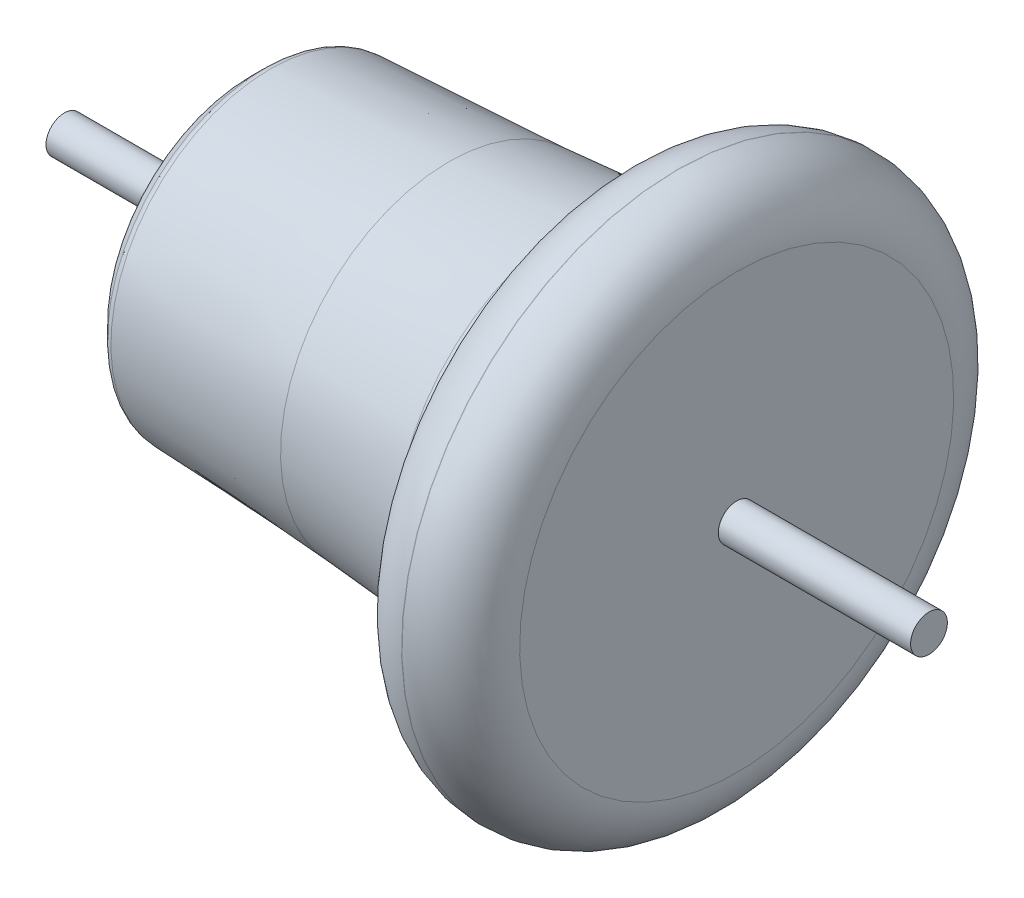
ISO-10303-21;
HEADER;
FILE_DESCRIPTION(('STEP AP214'),'2;1');
FILE_NAME('part.step','',(''),(''),'','','');
FILE_SCHEMA(('AUTOMOTIVE_DESIGN { 1 0 10303 214 1 1 1 1 }'));
ENDSEC;
DATA;
#1=APPLICATION_CONTEXT('core data for automotive mechanical design processes');
#2=APPLICATION_PROTOCOL_DEFINITION('international standard','automotive_design',2000,#1);
#3=PRODUCT_CONTEXT('',#1,'mechanical');
#4=PRODUCT('Part','Part','',(#3));
#5=PRODUCT_RELATED_PRODUCT_CATEGORY('part','',(#4));
#6=PRODUCT_DEFINITION_FORMATION('','',#4);
#7=PRODUCT_DEFINITION_CONTEXT('part definition',#1,'design');
#8=PRODUCT_DEFINITION('design','',#6,#7);
#9=PRODUCT_DEFINITION_SHAPE('','',#8);
#10=(LENGTH_UNIT() NAMED_UNIT(*) SI_UNIT(.MILLI.,.METRE.));
#11=(NAMED_UNIT(*) PLANE_ANGLE_UNIT() SI_UNIT($,.RADIAN.));
#12=(NAMED_UNIT(*) SI_UNIT($,.STERADIAN.) SOLID_ANGLE_UNIT());
#13=UNCERTAINTY_MEASURE_WITH_UNIT(LENGTH_MEASURE(1.E-05),#10,'distance_accuracy_value','');
#14=(GEOMETRIC_REPRESENTATION_CONTEXT(3) GLOBAL_UNCERTAINTY_ASSIGNED_CONTEXT((#13)) GLOBAL_UNIT_ASSIGNED_CONTEXT((#10,
#11,#12)) REPRESENTATION_CONTEXT('',''));
#15=CARTESIAN_POINT('',(0.,0.,0.));
#16=DIRECTION('',(0.,0.,1.));
#17=DIRECTION('',(1.,0.,0.));
#18=AXIS2_PLACEMENT_3D('',#15,#16,#17);
#19=CARTESIAN_POINT('',(-126.642185360927,125.,0.));
#20=DIRECTION('',(1.,0.,0.));
#21=DIRECTION('',(0.,1.,0.));
#22=AXIS2_PLACEMENT_3D('',#19,#20,#21);
#23=TOROIDAL_SURFACE('',#22,40.8262143641939,2.49999999999999);
#24=CARTESIAN_POINT('',(-128.409952313894,125.,0.));
#25=DIRECTION('',(1.,0.,0.));
#26=DIRECTION('',(0.,1.,0.));
#27=AXIS2_PLACEMENT_3D('',#24,#25,#26);
#28=CIRCLE('',#27,42.5939813171604);
#29=CARTESIAN_POINT('',(-128.409952313894,167.59398131716,0.));
#30=VERTEX_POINT('',#29);
#31=EDGE_CURVE('E57',#30,#30,#28,.T.);
#32=ORIENTED_EDGE('',*,*,#31,.T.);
#33=EDGE_LOOP('',(#32));
#34=FACE_BOUND('',#33,.T.);
#35=CARTESIAN_POINT('',(-126.767029403287,125.,0.));
#36=DIRECTION('',(1.,0.,0.));
#37=DIRECTION('',(0.,1.,0.));
#38=AXIS2_PLACEMENT_3D('',#35,#36,#37);
#39=CIRCLE('',#38,43.3230952113884);
#40=CARTESIAN_POINT('',(-126.767029403287,168.323095211388,0.));
#41=VERTEX_POINT('',#40);
#42=EDGE_CURVE('E52',#41,#41,#39,.T.);
#43=ORIENTED_EDGE('',*,*,#42,.F.);
#44=EDGE_LOOP('',(#43));
#45=FACE_BOUND('',#44,.T.);
#46=ADVANCED_FACE('F39',(#34,#45),#23,.T.);
#47=CARTESIAN_POINT('',(-126.767029403287,125.,0.));
#48=DIRECTION('',(1.,0.,0.));
#49=DIRECTION('',(0.,1.,0.));
#50=AXIS2_PLACEMENT_3D('',#47,#48,#49);
#51=CONICAL_SURFACE('',#50,43.3230952113884,0.049958395721942);
#52=CARTESIAN_POINT('',(-78.2289336310536,125.,0.));
#53=DIRECTION('',(1.,0.,0.));
#54=DIRECTION('',(0.,1.,0.));
#55=AXIS2_PLACEMENT_3D('',#52,#53,#54);
#56=CIRCLE('',#55,45.75);
#57=CARTESIAN_POINT('',(-78.2289336310536,170.75,0.));
#58=VERTEX_POINT('',#57);
#59=EDGE_CURVE('E101',#58,#58,#56,.T.);
#60=ORIENTED_EDGE('',*,*,#59,.F.);
#61=EDGE_LOOP('',(#60));
#62=FACE_BOUND('',#61,.T.);
#63=ORIENTED_EDGE('',*,*,#42,.T.);
#64=EDGE_LOOP('',(#63));
#65=FACE_BOUND('',#64,.T.);
#66=ADVANCED_FACE('F108',(#62,#65),#51,.T.);
#67=CARTESIAN_POINT('',(-93.2102187142211,125.,0.));
#68=DIRECTION('',(1.,0.,0.));
#69=DIRECTION('',(0.,1.,0.));
#70=AXIS2_PLACEMENT_3D('',#67,#68,#69);
#71=TOROIDAL_SURFACE('',#70,345.375701663353,300.);
#72=ORIENTED_EDGE('',*,*,#59,.T.);
#73=EDGE_LOOP('',(#72));
#74=FACE_BOUND('',#73,.T.);
#75=CARTESIAN_POINT('',(-43.1230355182371,125.,0.));
#76=DIRECTION('',(1.,0.,0.));
#77=DIRECTION('',(0.,1.,0.));
#78=AXIS2_PLACEMENT_3D('',#75,#76,#77);
#79=CIRCLE('',#78,49.5864623738013);
#80=CARTESIAN_POINT('',(-43.1230355182371,174.586462373801,0.));
#81=VERTEX_POINT('',#80);
#82=EDGE_CURVE('E97',#81,#81,#79,.T.);
#83=ORIENTED_EDGE('',*,*,#82,.F.);
#84=EDGE_LOOP('',(#83));
#85=FACE_BOUND('',#84,.T.);
#86=ADVANCED_FACE('F115',(#74,#85),#71,.F.);
#87=CARTESIAN_POINT('',(-44.7926082914366,125.,0.));
#88=DIRECTION('',(1.,0.,0.));
#89=DIRECTION('',(0.,1.,0.));
#90=AXIS2_PLACEMENT_3D('',#87,#88,#89);
#91=TOROIDAL_SURFACE('',#90,59.4461036834531,9.99999999999997);
#92=ORIENTED_EDGE('',*,*,#82,.T.);
#93=EDGE_LOOP('',(#92));
#94=FACE_BOUND('',#93,.T.);
#95=CARTESIAN_POINT('',(-39.1692863776974,125.,0.));
#96=DIRECTION('',(1.,0.,0.));
#97=DIRECTION('',(0.,1.,0.));
#98=AXIS2_PLACEMENT_3D('',#95,#96,#97);
#99=CIRCLE('',#98,51.1769894228772);
#100=CARTESIAN_POINT('',(-39.1692863776974,176.176989422877,0.));
#101=VERTEX_POINT('',#100);
#102=EDGE_CURVE('E93',#101,#101,#99,.T.);
#103=ORIENTED_EDGE('',*,*,#102,.F.);
#104=EDGE_LOOP('',(#103));
#105=FACE_BOUND('',#104,.T.);
#106=ADVANCED_FACE('F166',(#94,#105),#91,.F.);
#107=CARTESIAN_POINT('',(-48.7289336310541,125.,0.));
#108=DIRECTION('',(1.,0.,0.));
#109=DIRECTION('',(0.,1.,0.));
#110=AXIS2_PLACEMENT_3D('',#107,#108,#109);
#111=TOROIDAL_SURFACE('',#110,65.2344836658562,17.);
#112=ORIENTED_EDGE('',*,*,#102,.T.);
#113=EDGE_LOOP('',(#112));
#114=FACE_BOUND('',#113,.T.);
#115=CARTESIAN_POINT('',(-32.7541590776937,125.,0.));
#116=DIRECTION('',(1.,0.,0.));
#117=DIRECTION('',(0.,1.,0.));
#118=AXIS2_PLACEMENT_3D('',#115,#116,#117);
#119=CIRCLE('',#118,59.4201412293197);
#120=CARTESIAN_POINT('',(-32.7541590776937,184.42014122932,0.));
#121=VERTEX_POINT('',#120);
#122=EDGE_CURVE('E89',#121,#121,#119,.T.);
#123=ORIENTED_EDGE('',*,*,#122,.F.);
#124=EDGE_LOOP('',(#123));
#125=FACE_BOUND('',#124,.T.);
#126=ADVANCED_FACE('F162',(#114,#125),#111,.F.);
#127=CARTESIAN_POINT('',(-32.0567613252065,125.,0.));
#128=DIRECTION('',(1.,0.,0.));
#129=DIRECTION('',(0.,1.,0.));
#130=AXIS2_PLACEMENT_3D('',#127,#128,#129);
#131=CONICAL_SURFACE('',#130,61.3362258066565,1.22173047639602);
#132=ORIENTED_EDGE('',*,*,#122,.T.);
#133=EDGE_LOOP('',(#132));
#134=FACE_BOUND('',#133,.T.);
#135=CARTESIAN_POINT('',(-32.0567613252065,125.,0.));
#136=DIRECTION('',(1.,0.,0.));
#137=DIRECTION('',(0.,1.,0.));
#138=AXIS2_PLACEMENT_3D('',#135,#136,#137);
#139=CIRCLE('',#138,61.3362258066565);
#140=CARTESIAN_POINT('',(-32.0567613252065,186.336225806656,0.));
#141=VERTEX_POINT('',#140);
#142=EDGE_CURVE('E85',#141,#141,#139,.T.);
#143=ORIENTED_EDGE('',*,*,#142,.F.);
#144=EDGE_LOOP('',(#143));
#145=FACE_BOUND('',#144,.T.);
#146=ADVANCED_FACE('F158',(#134,#145),#131,.T.);
#147=CARTESIAN_POINT('',(-41.4536875330656,125.,0.));
#148=DIRECTION('',(1.,0.,0.));
#149=DIRECTION('',(0.,1.,0.));
#150=AXIS2_PLACEMENT_3D('',#147,#148,#149);
#151=TOROIDAL_SURFACE('',#150,64.7564272399133,10.);
#152=ORIENTED_EDGE('',*,*,#142,.T.);
#153=EDGE_LOOP('',(#152));
#154=FACE_BOUND('',#153,.T.);
#155=CARTESIAN_POINT('',(-31.7018591092149,125.,0.));
#156=DIRECTION('',(1.,0.,0.));
#157=DIRECTION('',(0.,1.,0.));
#158=AXIS2_PLACEMENT_3D('',#155,#156,#157);
#159=CIRCLE('',#158,62.5424167630236);
#160=CARTESIAN_POINT('',(-31.7018591092149,187.542416763023,0.));
#161=VERTEX_POINT('',#160);
#162=EDGE_CURVE('E81',#161,#161,#159,.T.);
#163=ORIENTED_EDGE('',*,*,#162,.F.);
#164=EDGE_LOOP('',(#163));
#165=FACE_BOUND('',#164,.T.);
#166=ADVANCED_FACE('F154',(#154,#165),#151,.F.);
#167=CARTESIAN_POINT('',(-16.0989336310538,125.,0.));
#168=DIRECTION('',(1.,0.,0.));
#169=DIRECTION('',(0.,1.,0.));
#170=AXIS2_PLACEMENT_3D('',#167,#168,#169);
#171=TOROIDAL_SURFACE('',#170,59.,16.);
#172=CARTESIAN_POINT('',(-16.0989336310538,125.,0.));
#173=DIRECTION('',(1.,0.,0.));
#174=DIRECTION('',(0.,1.,0.));
#175=AXIS2_PLACEMENT_3D('',#172,#173,#174);
#176=CIRCLE('',#175,75.);
#177=CARTESIAN_POINT('',(-16.0989336310538,200.,0.));
#178=VERTEX_POINT('',#177);
#179=EDGE_CURVE('E77',#178,#178,#176,.T.);
#180=ORIENTED_EDGE('',*,*,#179,.F.);
#181=EDGE_LOOP('',(#180));
#182=FACE_BOUND('',#181,.T.);
#183=ORIENTED_EDGE('',*,*,#162,.T.);
#184=EDGE_LOOP('',(#183));
#185=FACE_BOUND('',#184,.T.);
#186=ADVANCED_FACE('F150',(#182,#185),#171,.T.);
#187=CARTESIAN_POINT('',(0.,125.,0.));
#188=DIRECTION('',(1.,0.,0.));
#189=DIRECTION('',(0.,1.,0.));
#190=AXIS2_PLACEMENT_3D('',#187,#188,#189);
#191=CYLINDRICAL_SURFACE('',#190,75.);
#192=ORIENTED_EDGE('',*,*,#179,.T.);
#193=EDGE_LOOP('',(#192));
#194=FACE_BOUND('',#193,.T.);
#195=CARTESIAN_POINT('',(-16.,125.,0.));
#196=DIRECTION('',(1.,0.,0.));
#197=DIRECTION('',(0.,1.,0.));
#198=AXIS2_PLACEMENT_3D('',#195,#196,#197);
#199=CIRCLE('',#198,75.);
#200=CARTESIAN_POINT('',(-16.,200.,0.));
#201=VERTEX_POINT('',#200);
#202=EDGE_CURVE('E73',#201,#201,#199,.T.);
#203=ORIENTED_EDGE('',*,*,#202,.F.);
#204=EDGE_LOOP('',(#203));
#205=FACE_BOUND('',#204,.T.);
#206=ADVANCED_FACE('F146',(#194,#205),#191,.T.);
#207=CARTESIAN_POINT('',(-16.,125.,0.));
#208=DIRECTION('',(1.,0.,0.));
#209=DIRECTION('',(0.,1.,0.));
#210=AXIS2_PLACEMENT_3D('',#207,#208,#209);
#211=TOROIDAL_SURFACE('',#210,59.,16.);
#212=CARTESIAN_POINT('',(0.,125.,0.));
#213=DIRECTION('',(1.,0.,0.));
#214=DIRECTION('',(0.,1.,0.));
#215=AXIS2_PLACEMENT_3D('',#212,#213,#214);
#216=CIRCLE('',#215,59.);
#217=CARTESIAN_POINT('',(0.,184.,0.));
#218=VERTEX_POINT('',#217);
#219=EDGE_CURVE('E69',#218,#218,#216,.T.);
#220=ORIENTED_EDGE('',*,*,#219,.F.);
#221=EDGE_LOOP('',(#220));
#222=FACE_BOUND('',#221,.T.);
#223=ORIENTED_EDGE('',*,*,#202,.T.);
#224=EDGE_LOOP('',(#223));
#225=FACE_BOUND('',#224,.T.);
#226=ADVANCED_FACE('F142',(#222,#225),#211,.T.);
#227=CARTESIAN_POINT('',(0.,0.,0.));
#228=DIRECTION('',(1.,0.,0.));
#229=DIRECTION('',(0.,1.,0.));
#230=AXIS2_PLACEMENT_3D('',#227,#228,#229);
#231=PLANE('',#230);
#232=CARTESIAN_POINT('',(0.,125.,0.));
#233=DIRECTION('',(1.,0.,0.));
#234=DIRECTION('',(0.,1.,0.));
#235=AXIS2_PLACEMENT_3D('',#232,#233,#234);
#236=CIRCLE('',#235,5.00000000000001);
#237=CARTESIAN_POINT('',(0.,130.,0.));
#238=VERTEX_POINT('',#237);
#239=EDGE_CURVE('E10',#238,#238,#236,.T.);
#240=ORIENTED_EDGE('',*,*,#239,.F.);
#241=EDGE_LOOP('',(#240));
#242=FACE_BOUND('',#241,.T.);
#243=ORIENTED_EDGE('',*,*,#219,.T.);
#244=EDGE_LOOP('',(#243));
#245=FACE_BOUND('',#244,.T.);
#246=ADVANCED_FACE('F135',(#242,#245),#231,.T.);
#247=CARTESIAN_POINT('',(-132.728933631054,1.08195012077153E-12,0.));
#248=DIRECTION('',(-1.,0.,0.));
#249=DIRECTION('',(0.,-1.,0.));
#250=AXIS2_PLACEMENT_3D('',#247,#248,#249);
#251=PLANE('',#250);
#252=CARTESIAN_POINT('',(-132.728933631054,125.,0.));
#253=DIRECTION('',(-1.,0.,0.));
#254=DIRECTION('',(0.,-1.,0.));
#255=AXIS2_PLACEMENT_3D('',#252,#253,#254);
#256=CIRCLE('',#255,5.00000000000001);
#257=CARTESIAN_POINT('',(-132.728933631054,120.,0.));
#258=VERTEX_POINT('',#257);
#259=EDGE_CURVE('E42',#258,#258,#256,.T.);
#260=ORIENTED_EDGE('',*,*,#259,.F.);
#261=EDGE_LOOP('',(#260));
#262=FACE_BOUND('',#261,.T.);
#263=CARTESIAN_POINT('',(-132.728933631053,125.,0.));
#264=DIRECTION('',(1.,0.,0.));
#265=DIRECTION('',(0.,1.,0.));
#266=AXIS2_PLACEMENT_3D('',#263,#264,#265);
#267=CIRCLE('',#266,37.2394660940675);
#268=CARTESIAN_POINT('',(-132.728933631053,162.239466094067,0.));
#269=VERTEX_POINT('',#268);
#270=EDGE_CURVE('E65',#269,#269,#267,.T.);
#271=ORIENTED_EDGE('',*,*,#270,.F.);
#272=EDGE_LOOP('',(#271));
#273=FACE_BOUND('',#272,.T.);
#274=ADVANCED_FACE('F128',(#262,#273),#251,.T.);
#275=CARTESIAN_POINT('',(-130.228933631054,125.,0.));
#276=DIRECTION('',(1.,0.,0.));
#277=DIRECTION('',(0.,1.,0.));
#278=AXIS2_PLACEMENT_3D('',#275,#276,#277);
#279=TOROIDAL_SURFACE('',#278,37.2394660940674,2.49999999999986);
#280=ORIENTED_EDGE('',*,*,#270,.T.);
#281=EDGE_LOOP('',(#280));
#282=FACE_BOUND('',#281,.T.);
#283=CARTESIAN_POINT('',(-131.99670058402,125.,0.));
#284=DIRECTION('',(1.,0.,0.));
#285=DIRECTION('',(0.,1.,0.));
#286=AXIS2_PLACEMENT_3D('',#283,#284,#285);
#287=CIRCLE('',#286,39.0072330470337);
#288=CARTESIAN_POINT('',(-131.99670058402,164.007233047034,0.));
#289=VERTEX_POINT('',#288);
#290=EDGE_CURVE('E61',#289,#289,#287,.T.);
#291=ORIENTED_EDGE('',*,*,#290,.F.);
#292=EDGE_LOOP('',(#291));
#293=FACE_BOUND('',#292,.T.);
#294=ADVANCED_FACE('F123',(#282,#293),#279,.T.);
#295=CARTESIAN_POINT('',(-131.99670058402,125.,0.));
#296=DIRECTION('',(1.,0.,0.));
#297=DIRECTION('',(0.,1.,0.));
#298=AXIS2_PLACEMENT_3D('',#295,#296,#297);
#299=CONICAL_SURFACE('',#298,39.0072330470337,0.785398163397471);
#300=ORIENTED_EDGE('',*,*,#31,.F.);
#301=EDGE_LOOP('',(#300));
#302=FACE_BOUND('',#301,.T.);
#303=ORIENTED_EDGE('',*,*,#290,.T.);
#304=EDGE_LOOP('',(#303));
#305=FACE_BOUND('',#304,.T.);
#306=ADVANCED_FACE('F119',(#302,#305),#299,.T.);
#307=CARTESIAN_POINT('',(-182.728933631054,125.,0.));
#308=DIRECTION('',(-1.,0.,0.));
#309=DIRECTION('',(0.,-1.,0.));
#310=AXIS2_PLACEMENT_3D('',#307,#308,#309);
#311=PLANE('',#310);
#312=CARTESIAN_POINT('',(-182.728933631054,125.,0.));
#313=DIRECTION('',(-1.,0.,0.));
#314=DIRECTION('',(0.,-1.,0.));
#315=AXIS2_PLACEMENT_3D('',#312,#313,#314);
#316=CIRCLE('',#315,5.00000000000001);
#317=CARTESIAN_POINT('',(-182.728933631054,120.,0.));
#318=VERTEX_POINT('',#317);
#319=EDGE_CURVE('E276',#318,#318,#316,.T.);
#320=ORIENTED_EDGE('',*,*,#319,.T.);
#321=EDGE_LOOP('',(#320));
#322=FACE_BOUND('',#321,.T.);
#323=ADVANCED_FACE('F122',(#322),#311,.T.);
#324=CARTESIAN_POINT('',(52.2710663689464,125.,0.));
#325=DIRECTION('',(-1.,0.,0.));
#326=DIRECTION('',(0.,-1.,0.));
#327=AXIS2_PLACEMENT_3D('',#324,#325,#326);
#328=CYLINDRICAL_SURFACE('',#327,5.00000000000001);
#329=ORIENTED_EDGE('',*,*,#259,.T.);
#330=EDGE_LOOP('',(#329));
#331=FACE_BOUND('',#330,.T.);
#332=ORIENTED_EDGE('',*,*,#319,.F.);
#333=EDGE_LOOP('',(#332));
#334=FACE_BOUND('',#333,.T.);
#335=ADVANCED_FACE('F240',(#331,#334),#328,.T.);
#336=ORIENTED_EDGE('',*,*,#239,.T.);
#337=EDGE_LOOP('',(#336));
#338=FACE_BOUND('',#337,.T.);
#339=CARTESIAN_POINT('',(52.2710663689464,125.,0.));
#340=DIRECTION('',(-1.,0.,0.));
#341=DIRECTION('',(0.,-1.,0.));
#342=AXIS2_PLACEMENT_3D('',#339,#340,#341);
#343=CIRCLE('',#342,5.00000000000001);
#344=CARTESIAN_POINT('',(52.2710663689464,120.,0.));
#345=VERTEX_POINT('',#344);
#346=EDGE_CURVE('E55',#345,#345,#343,.T.);
#347=ORIENTED_EDGE('',*,*,#346,.T.);
#348=EDGE_LOOP('',(#347));
#349=FACE_BOUND('',#348,.T.);
#350=ADVANCED_FACE('F251',(#338,#349),#328,.T.);
#351=CARTESIAN_POINT('',(52.2710663689464,125.,0.));
#352=DIRECTION('',(-1.,0.,0.));
#353=DIRECTION('',(0.,-1.,0.));
#354=AXIS2_PLACEMENT_3D('',#351,#352,#353);
#355=PLANE('',#354);
#356=ORIENTED_EDGE('',*,*,#346,.F.);
#357=EDGE_LOOP('',(#356));
#358=FACE_BOUND('',#357,.T.);
#359=ADVANCED_FACE('F260',(#358),#355,.F.);
#360=CLOSED_SHELL('',(#46,#66,#86,#106,#126,#146,#166,#186,#206,#226,#246,#274,#294,#306,#323,
#335,#350,#359));
#361=MANIFOLD_SOLID_BREP('B2',#360);
#362=ADVANCED_BREP_SHAPE_REPRESENTATION('',(#18,#361),#14);
#363=SHAPE_DEFINITION_REPRESENTATION(#9,#362);
ENDSEC;
END-ISO-10303-21;
